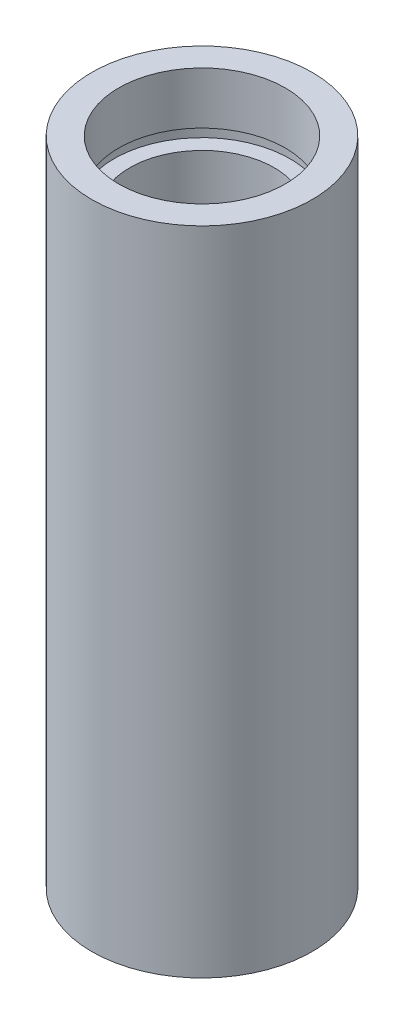
ISO-10303-21;
HEADER;
FILE_DESCRIPTION(('STEP AP214'),'2;1');
FILE_NAME('part.step','',(''),(''),'','','');
FILE_SCHEMA(('AUTOMOTIVE_DESIGN { 1 0 10303 214 1 1 1 1 }'));
ENDSEC;
DATA;
#1=APPLICATION_CONTEXT('core data for automotive mechanical design processes');
#2=APPLICATION_PROTOCOL_DEFINITION('international standard','automotive_design',2000,#1);
#3=PRODUCT_CONTEXT('',#1,'mechanical');
#4=PRODUCT('Part','Part','',(#3));
#5=PRODUCT_RELATED_PRODUCT_CATEGORY('part','',(#4));
#6=PRODUCT_DEFINITION_FORMATION('','',#4);
#7=PRODUCT_DEFINITION_CONTEXT('part definition',#1,'design');
#8=PRODUCT_DEFINITION('design','',#6,#7);
#9=PRODUCT_DEFINITION_SHAPE('','',#8);
#10=(LENGTH_UNIT() NAMED_UNIT(*) SI_UNIT(.MILLI.,.METRE.));
#11=(NAMED_UNIT(*) PLANE_ANGLE_UNIT() SI_UNIT($,.RADIAN.));
#12=(NAMED_UNIT(*) SI_UNIT($,.STERADIAN.) SOLID_ANGLE_UNIT());
#13=UNCERTAINTY_MEASURE_WITH_UNIT(LENGTH_MEASURE(1.E-05),#10,'distance_accuracy_value','');
#14=(GEOMETRIC_REPRESENTATION_CONTEXT(3) GLOBAL_UNCERTAINTY_ASSIGNED_CONTEXT((#13)) GLOBAL_UNIT_ASSIGNED_CONTEXT((#10,
#11,#12)) REPRESENTATION_CONTEXT('',''));
#15=CARTESIAN_POINT('',(0.,0.,0.));
#16=DIRECTION('',(0.,0.,1.));
#17=DIRECTION('',(1.,0.,0.));
#18=AXIS2_PLACEMENT_3D('',#15,#16,#17);
#19=CARTESIAN_POINT('',(7.00000000000002,0.,0.));
#20=DIRECTION('',(0.,1.,0.));
#21=DIRECTION('',(0.,0.,1.));
#22=AXIS2_PLACEMENT_3D('',#19,#20,#21);
#23=PLANE('',#22);
#24=CARTESIAN_POINT('',(0.,0.,0.));
#25=DIRECTION('',(0.,1.,0.));
#26=DIRECTION('',(0.,0.,1.));
#27=AXIS2_PLACEMENT_3D('',#24,#25,#26);
#28=CIRCLE('',#27,9.52500000000002);
#29=CARTESIAN_POINT('',(0.,0.,9.52500000000002));
#30=VERTEX_POINT('',#29);
#31=EDGE_CURVE('E10',#30,#30,#28,.T.);
#32=ORIENTED_EDGE('',*,*,#31,.F.);
#33=EDGE_LOOP('',(#32));
#34=FACE_BOUND('',#33,.T.);
#35=CARTESIAN_POINT('',(0.,0.,0.));
#36=DIRECTION('',(0.,1.,0.));
#37=DIRECTION('',(0.,0.,1.));
#38=AXIS2_PLACEMENT_3D('',#35,#36,#37);
#39=CIRCLE('',#38,7.00000000000002);
#40=CARTESIAN_POINT('',(0.,0.,7.00000000000002));
#41=VERTEX_POINT('',#40);
#42=EDGE_CURVE('E77',#41,#41,#39,.T.);
#43=ORIENTED_EDGE('',*,*,#42,.T.);
#44=EDGE_LOOP('',(#43));
#45=FACE_BOUND('',#44,.T.);
#46=ADVANCED_FACE('F37',(#34,#45),#23,.F.);
#47=CARTESIAN_POINT('',(0.,161.376166943427,0.));
#48=DIRECTION('',(0.,1.,0.));
#49=DIRECTION('',(0.,0.,1.));
#50=AXIS2_PLACEMENT_3D('',#47,#48,#49);
#51=CYLINDRICAL_SURFACE('',#50,9.52500000000002);
#52=CARTESIAN_POINT('',(0.,56.3,0.));
#53=DIRECTION('',(0.,1.,0.));
#54=DIRECTION('',(0.,0.,1.));
#55=AXIS2_PLACEMENT_3D('',#52,#53,#54);
#56=CIRCLE('',#55,9.52500000000002);
#57=CARTESIAN_POINT('',(0.,56.3,9.52500000000002));
#58=VERTEX_POINT('',#57);
#59=EDGE_CURVE('E43',#58,#58,#56,.T.);
#60=ORIENTED_EDGE('',*,*,#59,.F.);
#61=EDGE_LOOP('',(#60));
#62=FACE_BOUND('',#61,.T.);
#63=ORIENTED_EDGE('',*,*,#31,.T.);
#64=EDGE_LOOP('',(#63));
#65=FACE_BOUND('',#64,.T.);
#66=ADVANCED_FACE('F138',(#62,#65),#51,.T.);
#67=CARTESIAN_POINT('',(7.20000000000001,56.3,0.));
#68=DIRECTION('',(0.,-1.,0.));
#69=DIRECTION('',(0.,0.,-1.));
#70=AXIS2_PLACEMENT_3D('',#67,#68,#69);
#71=PLANE('',#70);
#72=CARTESIAN_POINT('',(0.,56.3,0.));
#73=DIRECTION('',(0.,1.,0.));
#74=DIRECTION('',(0.,0.,1.));
#75=AXIS2_PLACEMENT_3D('',#72,#73,#74);
#76=CIRCLE('',#75,7.20000000000001);
#77=CARTESIAN_POINT('',(0.,56.3,7.20000000000001));
#78=VERTEX_POINT('',#77);
#79=EDGE_CURVE('E47',#78,#78,#76,.T.);
#80=ORIENTED_EDGE('',*,*,#79,.F.);
#81=EDGE_LOOP('',(#80));
#82=FACE_BOUND('',#81,.T.);
#83=ORIENTED_EDGE('',*,*,#59,.T.);
#84=EDGE_LOOP('',(#83));
#85=FACE_BOUND('',#84,.T.);
#86=ADVANCED_FACE('F133',(#82,#85),#71,.F.);
#87=CARTESIAN_POINT('',(0.,161.376166943427,0.));
#88=DIRECTION('',(0.,1.,0.));
#89=DIRECTION('',(0.,0.,1.));
#90=AXIS2_PLACEMENT_3D('',#87,#88,#89);
#91=CYLINDRICAL_SURFACE('',#90,7.20000000000001);
#92=CARTESIAN_POINT('',(0.,51.8,0.));
#93=DIRECTION('',(0.,1.,0.));
#94=DIRECTION('',(0.,0.,1.));
#95=AXIS2_PLACEMENT_3D('',#92,#93,#94);
#96=CIRCLE('',#95,7.20000000000001);
#97=CARTESIAN_POINT('',(0.,51.8,7.20000000000001));
#98=VERTEX_POINT('',#97);
#99=EDGE_CURVE('E51',#98,#98,#96,.T.);
#100=ORIENTED_EDGE('',*,*,#99,.F.);
#101=EDGE_LOOP('',(#100));
#102=FACE_BOUND('',#101,.T.);
#103=ORIENTED_EDGE('',*,*,#79,.T.);
#104=EDGE_LOOP('',(#103));
#105=FACE_BOUND('',#104,.T.);
#106=ADVANCED_FACE('F127',(#102,#105),#91,.F.);
#107=CARTESIAN_POINT('',(7.20000000000001,51.8,0.));
#108=DIRECTION('',(0.,1.,0.));
#109=DIRECTION('',(0.,0.,1.));
#110=AXIS2_PLACEMENT_3D('',#107,#108,#109);
#111=PLANE('',#110);
#112=CARTESIAN_POINT('',(0.,51.8,0.));
#113=DIRECTION('',(0.,1.,0.));
#114=DIRECTION('',(0.,0.,1.));
#115=AXIS2_PLACEMENT_3D('',#112,#113,#114);
#116=CIRCLE('',#115,7.60000000000002);
#117=CARTESIAN_POINT('',(0.,51.8,7.60000000000002));
#118=VERTEX_POINT('',#117);
#119=EDGE_CURVE('E56',#118,#118,#116,.T.);
#120=ORIENTED_EDGE('',*,*,#119,.F.);
#121=EDGE_LOOP('',(#120));
#122=FACE_BOUND('',#121,.T.);
#123=ORIENTED_EDGE('',*,*,#99,.T.);
#124=EDGE_LOOP('',(#123));
#125=FACE_BOUND('',#124,.T.);
#126=ADVANCED_FACE('F121',(#122,#125),#111,.F.);
#127=CARTESIAN_POINT('',(0.,161.376166943427,0.));
#128=DIRECTION('',(0.,1.,0.));
#129=DIRECTION('',(0.,0.,1.));
#130=AXIS2_PLACEMENT_3D('',#127,#128,#129);
#131=CYLINDRICAL_SURFACE('',#130,7.60000000000002);
#132=CARTESIAN_POINT('',(0.,50.8,0.));
#133=DIRECTION('',(0.,1.,0.));
#134=DIRECTION('',(0.,0.,1.));
#135=AXIS2_PLACEMENT_3D('',#132,#133,#134);
#136=CIRCLE('',#135,7.60000000000002);
#137=CARTESIAN_POINT('',(0.,50.8,7.60000000000002));
#138=VERTEX_POINT('',#137);
#139=EDGE_CURVE('E59',#138,#138,#136,.T.);
#140=ORIENTED_EDGE('',*,*,#139,.F.);
#141=EDGE_LOOP('',(#140));
#142=FACE_BOUND('',#141,.T.);
#143=ORIENTED_EDGE('',*,*,#119,.T.);
#144=EDGE_LOOP('',(#143));
#145=FACE_BOUND('',#144,.T.);
#146=ADVANCED_FACE('F115',(#142,#145),#131,.F.);
#147=CARTESIAN_POINT('',(6.25000000000002,50.8,0.));
#148=DIRECTION('',(0.,-1.,0.));
#149=DIRECTION('',(0.,0.,-1.));
#150=AXIS2_PLACEMENT_3D('',#147,#148,#149);
#151=PLANE('',#150);
#152=CARTESIAN_POINT('',(0.,50.8,0.));
#153=DIRECTION('',(0.,1.,0.));
#154=DIRECTION('',(0.,0.,1.));
#155=AXIS2_PLACEMENT_3D('',#152,#153,#154);
#156=CIRCLE('',#155,6.25000000000002);
#157=CARTESIAN_POINT('',(0.,50.8,6.25000000000002));
#158=VERTEX_POINT('',#157);
#159=EDGE_CURVE('E62',#158,#158,#156,.T.);
#160=ORIENTED_EDGE('',*,*,#159,.F.);
#161=EDGE_LOOP('',(#160));
#162=FACE_BOUND('',#161,.T.);
#163=ORIENTED_EDGE('',*,*,#139,.T.);
#164=EDGE_LOOP('',(#163));
#165=FACE_BOUND('',#164,.T.);
#166=ADVANCED_FACE('F109',(#162,#165),#151,.F.);
#167=CARTESIAN_POINT('',(0.,161.376166943427,0.));
#168=DIRECTION('',(0.,1.,0.));
#169=DIRECTION('',(0.,0.,1.));
#170=AXIS2_PLACEMENT_3D('',#167,#168,#169);
#171=CYLINDRICAL_SURFACE('',#170,6.25000000000002);
#172=CARTESIAN_POINT('',(0.,5.49999999999998,0.));
#173=DIRECTION('',(0.,1.,0.));
#174=DIRECTION('',(0.,0.,1.));
#175=AXIS2_PLACEMENT_3D('',#172,#173,#174);
#176=CIRCLE('',#175,6.25000000000002);
#177=CARTESIAN_POINT('',(0.,5.49999999999998,6.25000000000002));
#178=VERTEX_POINT('',#177);
#179=EDGE_CURVE('E65',#178,#178,#176,.T.);
#180=ORIENTED_EDGE('',*,*,#179,.F.);
#181=EDGE_LOOP('',(#180));
#182=FACE_BOUND('',#181,.T.);
#183=ORIENTED_EDGE('',*,*,#159,.T.);
#184=EDGE_LOOP('',(#183));
#185=FACE_BOUND('',#184,.T.);
#186=ADVANCED_FACE('F103',(#182,#185),#171,.F.);
#187=CARTESIAN_POINT('',(6.25000000000002,5.49999999999998,0.));
#188=DIRECTION('',(0.,1.,0.));
#189=DIRECTION('',(0.,0.,1.));
#190=AXIS2_PLACEMENT_3D('',#187,#188,#189);
#191=PLANE('',#190);
#192=CARTESIAN_POINT('',(0.,5.49999999999998,0.));
#193=DIRECTION('',(0.,1.,0.));
#194=DIRECTION('',(0.,0.,1.));
#195=AXIS2_PLACEMENT_3D('',#192,#193,#194);
#196=CIRCLE('',#195,7.60000000000002);
#197=CARTESIAN_POINT('',(0.,5.49999999999998,7.60000000000002));
#198=VERTEX_POINT('',#197);
#199=EDGE_CURVE('E68',#198,#198,#196,.T.);
#200=ORIENTED_EDGE('',*,*,#199,.F.);
#201=EDGE_LOOP('',(#200));
#202=FACE_BOUND('',#201,.T.);
#203=ORIENTED_EDGE('',*,*,#179,.T.);
#204=EDGE_LOOP('',(#203));
#205=FACE_BOUND('',#204,.T.);
#206=ADVANCED_FACE('F97',(#202,#205),#191,.F.);
#207=CARTESIAN_POINT('',(0.,161.376166943427,0.));
#208=DIRECTION('',(0.,1.,0.));
#209=DIRECTION('',(0.,0.,1.));
#210=AXIS2_PLACEMENT_3D('',#207,#208,#209);
#211=CYLINDRICAL_SURFACE('',#210,7.60000000000002);
#212=CARTESIAN_POINT('',(0.,4.49999999999998,0.));
#213=DIRECTION('',(0.,1.,0.));
#214=DIRECTION('',(0.,0.,1.));
#215=AXIS2_PLACEMENT_3D('',#212,#213,#214);
#216=CIRCLE('',#215,7.60000000000002);
#217=CARTESIAN_POINT('',(0.,4.49999999999998,7.60000000000002));
#218=VERTEX_POINT('',#217);
#219=EDGE_CURVE('E71',#218,#218,#216,.T.);
#220=ORIENTED_EDGE('',*,*,#219,.F.);
#221=EDGE_LOOP('',(#220));
#222=FACE_BOUND('',#221,.T.);
#223=ORIENTED_EDGE('',*,*,#199,.T.);
#224=EDGE_LOOP('',(#223));
#225=FACE_BOUND('',#224,.T.);
#226=ADVANCED_FACE('F91',(#222,#225),#211,.F.);
#227=CARTESIAN_POINT('',(7.00000000000002,4.49999999999998,0.));
#228=DIRECTION('',(0.,-1.,0.));
#229=DIRECTION('',(0.,0.,-1.));
#230=AXIS2_PLACEMENT_3D('',#227,#228,#229);
#231=PLANE('',#230);
#232=CARTESIAN_POINT('',(0.,4.49999999999998,0.));
#233=DIRECTION('',(0.,1.,0.));
#234=DIRECTION('',(0.,0.,1.));
#235=AXIS2_PLACEMENT_3D('',#232,#233,#234);
#236=CIRCLE('',#235,7.00000000000002);
#237=CARTESIAN_POINT('',(0.,4.49999999999998,7.00000000000002));
#238=VERTEX_POINT('',#237);
#239=EDGE_CURVE('E74',#238,#238,#236,.T.);
#240=ORIENTED_EDGE('',*,*,#239,.F.);
#241=EDGE_LOOP('',(#240));
#242=FACE_BOUND('',#241,.T.);
#243=ORIENTED_EDGE('',*,*,#219,.T.);
#244=EDGE_LOOP('',(#243));
#245=FACE_BOUND('',#244,.T.);
#246=ADVANCED_FACE('F85',(#242,#245),#231,.F.);
#247=CARTESIAN_POINT('',(0.,161.376166943427,0.));
#248=DIRECTION('',(0.,1.,0.));
#249=DIRECTION('',(0.,0.,1.));
#250=AXIS2_PLACEMENT_3D('',#247,#248,#249);
#251=CYLINDRICAL_SURFACE('',#250,7.00000000000002);
#252=ORIENTED_EDGE('',*,*,#42,.F.);
#253=EDGE_LOOP('',(#252));
#254=FACE_BOUND('',#253,.T.);
#255=ORIENTED_EDGE('',*,*,#239,.T.);
#256=EDGE_LOOP('',(#255));
#257=FACE_BOUND('',#256,.T.);
#258=ADVANCED_FACE('F82',(#254,#257),#251,.F.);
#259=CLOSED_SHELL('',(#46,#66,#86,#106,#126,#146,#166,#186,#206,#226,#246,#258));
#260=MANIFOLD_SOLID_BREP('B2',#259);
#261=ADVANCED_BREP_SHAPE_REPRESENTATION('',(#18,#260),#14);
#262=SHAPE_DEFINITION_REPRESENTATION(#9,#261);
ENDSEC;
END-ISO-10303-21;
